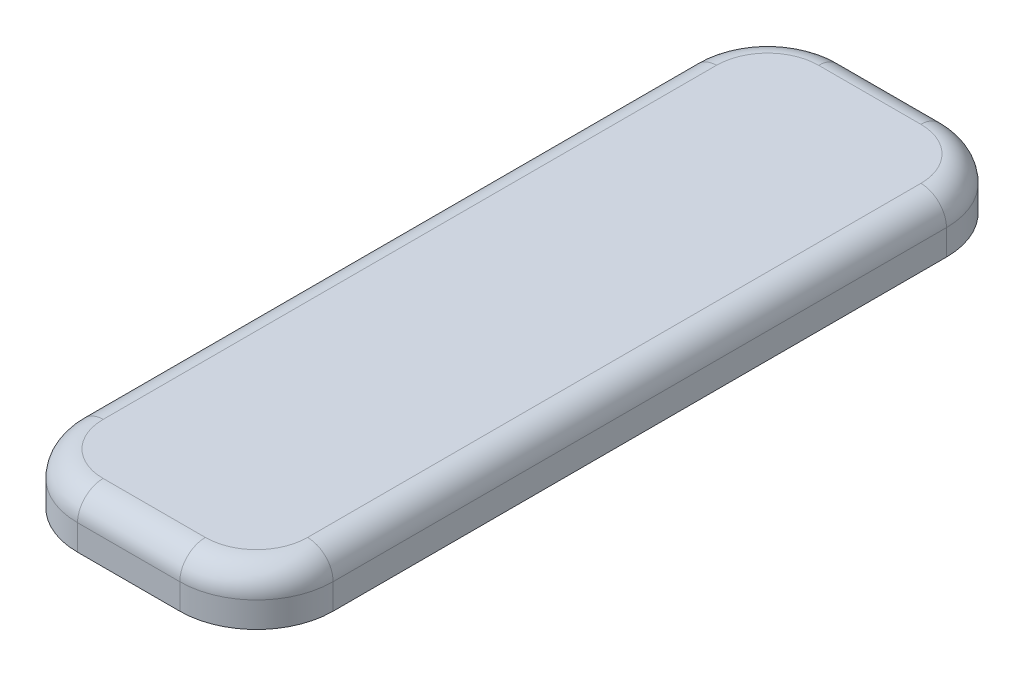
ISO-10303-21;
HEADER;
FILE_DESCRIPTION(('STEP AP214'),'2;1');
FILE_NAME('part.step','',(''),(''),'','','');
FILE_SCHEMA(('AUTOMOTIVE_DESIGN { 1 0 10303 214 1 1 1 1 }'));
ENDSEC;
DATA;
#1=APPLICATION_CONTEXT('core data for automotive mechanical design processes');
#2=APPLICATION_PROTOCOL_DEFINITION('international standard','automotive_design',2000,#1);
#3=PRODUCT_CONTEXT('',#1,'mechanical');
#4=PRODUCT('Part','Part','',(#3));
#5=PRODUCT_RELATED_PRODUCT_CATEGORY('part','',(#4));
#6=PRODUCT_DEFINITION_FORMATION('','',#4);
#7=PRODUCT_DEFINITION_CONTEXT('part definition',#1,'design');
#8=PRODUCT_DEFINITION('design','',#6,#7);
#9=PRODUCT_DEFINITION_SHAPE('','',#8);
#10=(LENGTH_UNIT() NAMED_UNIT(*) SI_UNIT(.MILLI.,.METRE.));
#11=(NAMED_UNIT(*) PLANE_ANGLE_UNIT() SI_UNIT($,.RADIAN.));
#12=(NAMED_UNIT(*) SI_UNIT($,.STERADIAN.) SOLID_ANGLE_UNIT());
#13=UNCERTAINTY_MEASURE_WITH_UNIT(LENGTH_MEASURE(1.E-05),#10,'distance_accuracy_value','');
#14=(GEOMETRIC_REPRESENTATION_CONTEXT(3) GLOBAL_UNCERTAINTY_ASSIGNED_CONTEXT((#13)) GLOBAL_UNIT_ASSIGNED_CONTEXT((#10,
#11,#12)) REPRESENTATION_CONTEXT('',''));
#15=CARTESIAN_POINT('',(0.,0.,0.));
#16=DIRECTION('',(0.,0.,1.));
#17=DIRECTION('',(1.,0.,0.));
#18=AXIS2_PLACEMENT_3D('',#15,#16,#17);
#19=CARTESIAN_POINT('',(-20.,20.,-120.));
#20=DIRECTION('',(0.,-1.,0.));
#21=DIRECTION('',(0.,0.,-1.));
#22=AXIS2_PLACEMENT_3D('',#19,#20,#21);
#23=CYLINDRICAL_SURFACE('',#22,30.);
#24=DIRECTION('',(0.,-1.,0.));
#25=VECTOR('',#24,1.);
#26=CARTESIAN_POINT('',(-50.,20.,-120.));
#27=LINE('',#26,#25);
#28=CARTESIAN_POINT('',(-50.,10.,-120.));
#29=VERTEX_POINT('',#28);
#30=CARTESIAN_POINT('',(-50.,0.,-120.));
#31=VERTEX_POINT('',#30);
#32=EDGE_CURVE('E124',#29,#31,#27,.T.);
#33=ORIENTED_EDGE('',*,*,#32,.F.);
#34=CARTESIAN_POINT('',(-20.,10.,-120.));
#35=DIRECTION('',(0.,-1.,0.));
#36=DIRECTION('',(0.,0.,-1.));
#37=AXIS2_PLACEMENT_3D('',#34,#35,#36);
#38=CIRCLE('',#37,30.);
#39=CARTESIAN_POINT('',(-19.9999999999998,10.,-150.));
#40=VERTEX_POINT('',#39);
#41=EDGE_CURVE('E11',#29,#40,#38,.T.);
#42=ORIENTED_EDGE('',*,*,#41,.T.);
#43=DIRECTION('',(0.,-1.,0.));
#44=VECTOR('',#43,1.);
#45=CARTESIAN_POINT('',(-19.9999999999998,20.,-150.));
#46=LINE('',#45,#44);
#47=CARTESIAN_POINT('',(-19.9999999999998,0.,-150.));
#48=VERTEX_POINT('',#47);
#49=EDGE_CURVE('E145',#40,#48,#46,.T.);
#50=ORIENTED_EDGE('',*,*,#49,.T.);
#51=CARTESIAN_POINT('',(-20.,0.,-120.));
#52=DIRECTION('',(0.,1.,0.));
#53=DIRECTION('',(0.,0.,-1.));
#54=AXIS2_PLACEMENT_3D('',#51,#52,#53);
#55=CIRCLE('',#54,30.);
#56=EDGE_CURVE('E139',#48,#31,#55,.T.);
#57=ORIENTED_EDGE('',*,*,#56,.T.);
#58=EDGE_LOOP('',(#33,#42,#50,#57));
#59=FACE_BOUND('',#58,.T.);
#60=ADVANCED_FACE('F36',(#59),#23,.T.);
#61=CARTESIAN_POINT('',(-50.,20.,120.));
#62=DIRECTION('',(1.,0.,0.));
#63=DIRECTION('',(0.,0.,-1.));
#64=AXIS2_PLACEMENT_3D('',#61,#62,#63);
#65=PLANE('',#64);
#66=DIRECTION('',(0.,-1.,0.));
#67=VECTOR('',#66,1.);
#68=CARTESIAN_POINT('',(-50.,20.,120.));
#69=LINE('',#68,#67);
#70=CARTESIAN_POINT('',(-50.,10.,120.));
#71=VERTEX_POINT('',#70);
#72=CARTESIAN_POINT('',(-50.,0.,120.));
#73=VERTEX_POINT('',#72);
#74=EDGE_CURVE('E133',#71,#73,#69,.T.);
#75=ORIENTED_EDGE('',*,*,#74,.F.);
#76=DIRECTION('',(0.,0.,1.));
#77=VECTOR('',#76,1.);
#78=CARTESIAN_POINT('',(-50.,10.,120.));
#79=LINE('',#78,#77);
#80=EDGE_CURVE('E45',#71,#29,#79,.F.);
#81=ORIENTED_EDGE('',*,*,#80,.T.);
#82=ORIENTED_EDGE('',*,*,#32,.T.);
#83=DIRECTION('',(0.,0.,1.));
#84=VECTOR('',#83,1.);
#85=CARTESIAN_POINT('',(-50.,0.,120.));
#86=LINE('',#85,#84);
#87=EDGE_CURVE('E127',#31,#73,#86,.T.);
#88=ORIENTED_EDGE('',*,*,#87,.T.);
#89=EDGE_LOOP('',(#75,#81,#82,#88));
#90=FACE_BOUND('',#89,.T.);
#91=ADVANCED_FACE('F126',(#90),#65,.F.);
#92=CARTESIAN_POINT('',(-20.,20.,120.));
#93=DIRECTION('',(0.,-1.,0.));
#94=DIRECTION('',(0.,0.,-1.));
#95=AXIS2_PLACEMENT_3D('',#92,#93,#94);
#96=CYLINDRICAL_SURFACE('',#95,30.);
#97=DIRECTION('',(0.,-1.,0.));
#98=VECTOR('',#97,1.);
#99=CARTESIAN_POINT('',(-19.9999999999998,20.,150.));
#100=LINE('',#99,#98);
#101=CARTESIAN_POINT('',(-19.9999999999998,10.,150.));
#102=VERTEX_POINT('',#101);
#103=CARTESIAN_POINT('',(-19.9999999999998,0.,150.));
#104=VERTEX_POINT('',#103);
#105=EDGE_CURVE('E175',#102,#104,#100,.T.);
#106=ORIENTED_EDGE('',*,*,#105,.F.);
#107=CARTESIAN_POINT('',(-20.,10.,120.));
#108=DIRECTION('',(0.,-1.,0.));
#109=DIRECTION('',(0.,0.,-1.));
#110=AXIS2_PLACEMENT_3D('',#107,#108,#109);
#111=CIRCLE('',#110,30.);
#112=EDGE_CURVE('E60',#102,#71,#111,.T.);
#113=ORIENTED_EDGE('',*,*,#112,.T.);
#114=ORIENTED_EDGE('',*,*,#74,.T.);
#115=CARTESIAN_POINT('',(-20.,0.,120.));
#116=DIRECTION('',(0.,1.,0.));
#117=DIRECTION('',(0.,0.,-1.));
#118=AXIS2_PLACEMENT_3D('',#115,#116,#117);
#119=CIRCLE('',#118,30.);
#120=EDGE_CURVE('E142',#73,#104,#119,.T.);
#121=ORIENTED_EDGE('',*,*,#120,.T.);
#122=EDGE_LOOP('',(#106,#113,#114,#121));
#123=FACE_BOUND('',#122,.T.);
#124=ADVANCED_FACE('F278',(#123),#96,.T.);
#125=CARTESIAN_POINT('',(-19.9999999999998,20.,150.));
#126=DIRECTION('',(0.,0.,-1.));
#127=DIRECTION('',(-1.,0.,0.));
#128=AXIS2_PLACEMENT_3D('',#125,#126,#127);
#129=PLANE('',#128);
#130=DIRECTION('',(0.,-1.,0.));
#131=VECTOR('',#130,1.);
#132=CARTESIAN_POINT('',(19.9999999999998,20.,150.));
#133=LINE('',#132,#131);
#134=CARTESIAN_POINT('',(19.9999999999998,10.,150.));
#135=VERTEX_POINT('',#134);
#136=CARTESIAN_POINT('',(19.9999999999998,0.,150.));
#137=VERTEX_POINT('',#136);
#138=EDGE_CURVE('E173',#135,#137,#133,.T.);
#139=ORIENTED_EDGE('',*,*,#138,.F.);
#140=DIRECTION('',(1.,0.,0.));
#141=VECTOR('',#140,1.);
#142=CARTESIAN_POINT('',(-19.9999999999998,10.,150.));
#143=LINE('',#142,#141);
#144=EDGE_CURVE('E203',#135,#102,#143,.F.);
#145=ORIENTED_EDGE('',*,*,#144,.T.);
#146=ORIENTED_EDGE('',*,*,#105,.T.);
#147=DIRECTION('',(1.,0.,0.));
#148=VECTOR('',#147,1.);
#149=CARTESIAN_POINT('',(-19.9999999999998,0.,150.));
#150=LINE('',#149,#148);
#151=EDGE_CURVE('E152',#104,#137,#150,.T.);
#152=ORIENTED_EDGE('',*,*,#151,.T.);
#153=EDGE_LOOP('',(#139,#145,#146,#152));
#154=FACE_BOUND('',#153,.T.);
#155=ADVANCED_FACE('F276',(#154),#129,.F.);
#156=CARTESIAN_POINT('',(20.,20.,120.));
#157=DIRECTION('',(0.,-1.,0.));
#158=DIRECTION('',(0.,0.,-1.));
#159=AXIS2_PLACEMENT_3D('',#156,#157,#158);
#160=CYLINDRICAL_SURFACE('',#159,30.);
#161=DIRECTION('',(0.,-1.,0.));
#162=VECTOR('',#161,1.);
#163=CARTESIAN_POINT('',(50.,20.,120.));
#164=LINE('',#163,#162);
#165=CARTESIAN_POINT('',(50.,10.,120.));
#166=VERTEX_POINT('',#165);
#167=CARTESIAN_POINT('',(50.,0.,120.));
#168=VERTEX_POINT('',#167);
#169=EDGE_CURVE('E171',#166,#168,#164,.T.);
#170=ORIENTED_EDGE('',*,*,#169,.F.);
#171=CARTESIAN_POINT('',(20.,10.,120.));
#172=DIRECTION('',(0.,-1.,0.));
#173=DIRECTION('',(0.,0.,-1.));
#174=AXIS2_PLACEMENT_3D('',#171,#172,#173);
#175=CIRCLE('',#174,30.);
#176=EDGE_CURVE('E201',#166,#135,#175,.T.);
#177=ORIENTED_EDGE('',*,*,#176,.T.);
#178=ORIENTED_EDGE('',*,*,#138,.T.);
#179=CARTESIAN_POINT('',(20.,0.,120.));
#180=DIRECTION('',(0.,1.,0.));
#181=DIRECTION('',(0.,0.,-1.));
#182=AXIS2_PLACEMENT_3D('',#179,#180,#181);
#183=CIRCLE('',#182,30.);
#184=EDGE_CURVE('E155',#137,#168,#183,.T.);
#185=ORIENTED_EDGE('',*,*,#184,.T.);
#186=EDGE_LOOP('',(#170,#177,#178,#185));
#187=FACE_BOUND('',#186,.T.);
#188=ADVANCED_FACE('F274',(#187),#160,.T.);
#189=CARTESIAN_POINT('',(50.,20.,120.));
#190=DIRECTION('',(-1.,0.,0.));
#191=DIRECTION('',(0.,0.,1.));
#192=AXIS2_PLACEMENT_3D('',#189,#190,#191);
#193=PLANE('',#192);
#194=DIRECTION('',(0.,-1.,0.));
#195=VECTOR('',#194,1.);
#196=CARTESIAN_POINT('',(50.,20.,-120.));
#197=LINE('',#196,#195);
#198=CARTESIAN_POINT('',(50.,10.,-120.));
#199=VERTEX_POINT('',#198);
#200=CARTESIAN_POINT('',(50.,0.,-120.));
#201=VERTEX_POINT('',#200);
#202=EDGE_CURVE('E169',#199,#201,#197,.T.);
#203=ORIENTED_EDGE('',*,*,#202,.F.);
#204=DIRECTION('',(0.,0.,-1.));
#205=VECTOR('',#204,1.);
#206=CARTESIAN_POINT('',(50.,10.,120.));
#207=LINE('',#206,#205);
#208=EDGE_CURVE('E199',#199,#166,#207,.F.);
#209=ORIENTED_EDGE('',*,*,#208,.T.);
#210=ORIENTED_EDGE('',*,*,#169,.T.);
#211=DIRECTION('',(0.,0.,-1.));
#212=VECTOR('',#211,1.);
#213=CARTESIAN_POINT('',(50.,0.,120.));
#214=LINE('',#213,#212);
#215=EDGE_CURVE('E158',#168,#201,#214,.T.);
#216=ORIENTED_EDGE('',*,*,#215,.T.);
#217=EDGE_LOOP('',(#203,#209,#210,#216));
#218=FACE_BOUND('',#217,.T.);
#219=ADVANCED_FACE('F262',(#218),#193,.F.);
#220=CARTESIAN_POINT('',(20.,20.,-120.));
#221=DIRECTION('',(0.,-1.,0.));
#222=DIRECTION('',(0.,0.,-1.));
#223=AXIS2_PLACEMENT_3D('',#220,#221,#222);
#224=CYLINDRICAL_SURFACE('',#223,30.);
#225=DIRECTION('',(0.,-1.,0.));
#226=VECTOR('',#225,1.);
#227=CARTESIAN_POINT('',(19.9999999999998,20.,-150.));
#228=LINE('',#227,#226);
#229=CARTESIAN_POINT('',(19.9999999999998,10.,-150.));
#230=VERTEX_POINT('',#229);
#231=CARTESIAN_POINT('',(19.9999999999998,0.,-150.));
#232=VERTEX_POINT('',#231);
#233=EDGE_CURVE('E167',#230,#232,#228,.T.);
#234=ORIENTED_EDGE('',*,*,#233,.F.);
#235=CARTESIAN_POINT('',(20.,10.,-120.));
#236=DIRECTION('',(0.,-1.,0.));
#237=DIRECTION('',(0.,0.,-1.));
#238=AXIS2_PLACEMENT_3D('',#235,#236,#237);
#239=CIRCLE('',#238,30.);
#240=EDGE_CURVE('E197',#230,#199,#239,.T.);
#241=ORIENTED_EDGE('',*,*,#240,.T.);
#242=ORIENTED_EDGE('',*,*,#202,.T.);
#243=CARTESIAN_POINT('',(20.,0.,-120.));
#244=DIRECTION('',(0.,1.,0.));
#245=DIRECTION('',(0.,0.,-1.));
#246=AXIS2_PLACEMENT_3D('',#243,#244,#245);
#247=CIRCLE('',#246,30.);
#248=EDGE_CURVE('E161',#201,#232,#247,.T.);
#249=ORIENTED_EDGE('',*,*,#248,.T.);
#250=EDGE_LOOP('',(#234,#241,#242,#249));
#251=FACE_BOUND('',#250,.T.);
#252=ADVANCED_FACE('F259',(#251),#224,.T.);
#253=CARTESIAN_POINT('',(-19.9999999999998,20.,-150.));
#254=DIRECTION('',(0.,0.,1.));
#255=DIRECTION('',(1.,0.,0.));
#256=AXIS2_PLACEMENT_3D('',#253,#254,#255);
#257=PLANE('',#256);
#258=ORIENTED_EDGE('',*,*,#49,.F.);
#259=DIRECTION('',(-1.,0.,0.));
#260=VECTOR('',#259,1.);
#261=CARTESIAN_POINT('',(-19.9999999999998,10.,-150.));
#262=LINE('',#261,#260);
#263=EDGE_CURVE('E194',#40,#230,#262,.F.);
#264=ORIENTED_EDGE('',*,*,#263,.T.);
#265=ORIENTED_EDGE('',*,*,#233,.T.);
#266=DIRECTION('',(-1.,0.,0.));
#267=VECTOR('',#266,1.);
#268=CARTESIAN_POINT('',(-19.9999999999998,0.,-150.));
#269=LINE('',#268,#267);
#270=EDGE_CURVE('E164',#232,#48,#269,.T.);
#271=ORIENTED_EDGE('',*,*,#270,.T.);
#272=EDGE_LOOP('',(#258,#264,#265,#271));
#273=FACE_BOUND('',#272,.T.);
#274=ADVANCED_FACE('F246',(#273),#257,.F.);
#275=CARTESIAN_POINT('',(-20.,20.,-120.));
#276=DIRECTION('',(0.,-1.,0.));
#277=DIRECTION('',(0.,0.,-1.));
#278=AXIS2_PLACEMENT_3D('',#275,#276,#277);
#279=PLANE('',#278);
#280=CARTESIAN_POINT('',(20.,20.,-120.));
#281=DIRECTION('',(0.,-1.,0.));
#282=DIRECTION('',(0.,0.,-1.));
#283=AXIS2_PLACEMENT_3D('',#280,#281,#282);
#284=CIRCLE('',#283,20.);
#285=CARTESIAN_POINT('',(40.,20.,-120.));
#286=VERTEX_POINT('',#285);
#287=CARTESIAN_POINT('',(19.9999999999998,20.,-140.));
#288=VERTEX_POINT('',#287);
#289=EDGE_CURVE('E189',#286,#288,#284,.F.);
#290=ORIENTED_EDGE('',*,*,#289,.T.);
#291=DIRECTION('',(-1.,0.,0.));
#292=VECTOR('',#291,1.);
#293=CARTESIAN_POINT('',(-20.,20.,-140.));
#294=LINE('',#293,#292);
#295=CARTESIAN_POINT('',(-19.9999999999998,20.,-140.));
#296=VERTEX_POINT('',#295);
#297=EDGE_CURVE('E191',#288,#296,#294,.T.);
#298=ORIENTED_EDGE('',*,*,#297,.T.);
#299=CARTESIAN_POINT('',(-20.,20.,-120.));
#300=DIRECTION('',(0.,-1.,0.));
#301=DIRECTION('',(0.,0.,-1.));
#302=AXIS2_PLACEMENT_3D('',#299,#300,#301);
#303=CIRCLE('',#302,20.);
#304=CARTESIAN_POINT('',(-40.,20.,-120.));
#305=VERTEX_POINT('',#304);
#306=EDGE_CURVE('E132',#296,#305,#303,.F.);
#307=ORIENTED_EDGE('',*,*,#306,.T.);
#308=DIRECTION('',(0.,0.,1.));
#309=VECTOR('',#308,1.);
#310=CARTESIAN_POINT('',(-40.,20.,-120.));
#311=LINE('',#310,#309);
#312=CARTESIAN_POINT('',(-40.,20.,120.));
#313=VERTEX_POINT('',#312);
#314=EDGE_CURVE('E179',#305,#313,#311,.T.);
#315=ORIENTED_EDGE('',*,*,#314,.T.);
#316=CARTESIAN_POINT('',(-20.,20.,120.));
#317=DIRECTION('',(0.,-1.,0.));
#318=DIRECTION('',(0.,0.,-1.));
#319=AXIS2_PLACEMENT_3D('',#316,#317,#318);
#320=CIRCLE('',#319,20.);
#321=CARTESIAN_POINT('',(-19.9999999999998,20.,140.));
#322=VERTEX_POINT('',#321);
#323=EDGE_CURVE('E181',#313,#322,#320,.F.);
#324=ORIENTED_EDGE('',*,*,#323,.T.);
#325=DIRECTION('',(1.,0.,0.));
#326=VECTOR('',#325,1.);
#327=CARTESIAN_POINT('',(-20.,20.,140.));
#328=LINE('',#327,#326);
#329=CARTESIAN_POINT('',(19.9999999999999,20.,140.));
#330=VERTEX_POINT('',#329);
#331=EDGE_CURVE('E183',#322,#330,#328,.T.);
#332=ORIENTED_EDGE('',*,*,#331,.T.);
#333=CARTESIAN_POINT('',(20.,20.,120.));
#334=DIRECTION('',(0.,-1.,0.));
#335=DIRECTION('',(0.,0.,-1.));
#336=AXIS2_PLACEMENT_3D('',#333,#334,#335);
#337=CIRCLE('',#336,20.);
#338=CARTESIAN_POINT('',(40.,20.,120.));
#339=VERTEX_POINT('',#338);
#340=EDGE_CURVE('E185',#330,#339,#337,.F.);
#341=ORIENTED_EDGE('',*,*,#340,.T.);
#342=DIRECTION('',(0.,0.,-1.));
#343=VECTOR('',#342,1.);
#344=CARTESIAN_POINT('',(40.,20.,-120.));
#345=LINE('',#344,#343);
#346=EDGE_CURVE('E187',#339,#286,#345,.T.);
#347=ORIENTED_EDGE('',*,*,#346,.T.);
#348=EDGE_LOOP('',(#290,#298,#307,#315,#324,#332,#341,#347));
#349=FACE_BOUND('',#348,.T.);
#350=ADVANCED_FACE('F234',(#349),#279,.F.);
#351=CARTESIAN_POINT('',(-20.,0.,-120.));
#352=DIRECTION('',(0.,-1.,0.));
#353=DIRECTION('',(0.,0.,-1.));
#354=AXIS2_PLACEMENT_3D('',#351,#352,#353);
#355=PLANE('',#354);
#356=ORIENTED_EDGE('',*,*,#56,.F.);
#357=ORIENTED_EDGE('',*,*,#270,.F.);
#358=ORIENTED_EDGE('',*,*,#248,.F.);
#359=ORIENTED_EDGE('',*,*,#215,.F.);
#360=ORIENTED_EDGE('',*,*,#184,.F.);
#361=ORIENTED_EDGE('',*,*,#151,.F.);
#362=ORIENTED_EDGE('',*,*,#120,.F.);
#363=ORIENTED_EDGE('',*,*,#87,.F.);
#364=EDGE_LOOP('',(#356,#357,#358,#359,#360,#361,#362,#363));
#365=FACE_BOUND('',#364,.T.);
#366=ADVANCED_FACE('F137',(#365),#355,.T.);
#367=CARTESIAN_POINT('',(-20.,10.,140.));
#368=DIRECTION('',(1.,0.,0.));
#369=DIRECTION('',(0.,0.,-1.));
#370=AXIS2_PLACEMENT_3D('',#367,#368,#369);
#371=CYLINDRICAL_SURFACE('',#370,10.);
#372=CARTESIAN_POINT('',(-19.9999999999998,10.,140.));
#373=DIRECTION('',(-1.,0.,0.));
#374=DIRECTION('',(0.,0.,1.));
#375=AXIS2_PLACEMENT_3D('',#372,#373,#374);
#376=CIRCLE('',#375,10.);
#377=EDGE_CURVE('E149',#102,#322,#376,.T.);
#378=ORIENTED_EDGE('',*,*,#377,.F.);
#379=ORIENTED_EDGE('',*,*,#144,.F.);
#380=CARTESIAN_POINT('',(19.9999999999999,10.,140.));
#381=DIRECTION('',(1.,0.,0.));
#382=DIRECTION('',(0.,0.,-1.));
#383=AXIS2_PLACEMENT_3D('',#380,#381,#382);
#384=CIRCLE('',#383,10.);
#385=EDGE_CURVE('E40',#330,#135,#384,.T.);
#386=ORIENTED_EDGE('',*,*,#385,.F.);
#387=ORIENTED_EDGE('',*,*,#331,.F.);
#388=EDGE_LOOP('',(#378,#379,#386,#387));
#389=FACE_BOUND('',#388,.T.);
#390=ADVANCED_FACE('F38',(#389),#371,.T.);
#391=CARTESIAN_POINT('',(20.,10.,120.));
#392=DIRECTION('',(0.,-1.,0.));
#393=DIRECTION('',(0.,0.,-1.));
#394=AXIS2_PLACEMENT_3D('',#391,#392,#393);
#395=TOROIDAL_SURFACE('',#394,20.,10.);
#396=ORIENTED_EDGE('',*,*,#385,.T.);
#397=ORIENTED_EDGE('',*,*,#176,.F.);
#398=CARTESIAN_POINT('',(40.,10.,120.));
#399=DIRECTION('',(0.,0.,-1.));
#400=DIRECTION('',(-1.,0.,0.));
#401=AXIS2_PLACEMENT_3D('',#398,#399,#400);
#402=CIRCLE('',#401,10.);
#403=EDGE_CURVE('E220',#339,#166,#402,.T.);
#404=ORIENTED_EDGE('',*,*,#403,.F.);
#405=ORIENTED_EDGE('',*,*,#340,.F.);
#406=EDGE_LOOP('',(#396,#397,#404,#405));
#407=FACE_BOUND('',#406,.T.);
#408=ADVANCED_FACE('F271',(#407),#395,.T.);
#409=CARTESIAN_POINT('',(-20.,10.,120.));
#410=DIRECTION('',(0.,-1.,0.));
#411=DIRECTION('',(0.,0.,-1.));
#412=AXIS2_PLACEMENT_3D('',#409,#410,#411);
#413=TOROIDAL_SURFACE('',#412,20.,10.);
#414=ORIENTED_EDGE('',*,*,#377,.T.);
#415=ORIENTED_EDGE('',*,*,#323,.F.);
#416=CARTESIAN_POINT('',(-40.,10.,120.));
#417=DIRECTION('',(0.,0.,-1.));
#418=DIRECTION('',(-1.,0.,0.));
#419=AXIS2_PLACEMENT_3D('',#416,#417,#418);
#420=CIRCLE('',#419,10.);
#421=EDGE_CURVE('E217',#71,#313,#420,.T.);
#422=ORIENTED_EDGE('',*,*,#421,.F.);
#423=ORIENTED_EDGE('',*,*,#112,.F.);
#424=EDGE_LOOP('',(#414,#415,#422,#423));
#425=FACE_BOUND('',#424,.T.);
#426=ADVANCED_FACE('F226',(#425),#413,.T.);
#427=CARTESIAN_POINT('',(40.,10.,-120.));
#428=DIRECTION('',(0.,0.,-1.));
#429=DIRECTION('',(-1.,0.,0.));
#430=AXIS2_PLACEMENT_3D('',#427,#428,#429);
#431=CYLINDRICAL_SURFACE('',#430,10.);
#432=ORIENTED_EDGE('',*,*,#403,.T.);
#433=ORIENTED_EDGE('',*,*,#208,.F.);
#434=CARTESIAN_POINT('',(40.,10.,-120.));
#435=DIRECTION('',(0.,0.,-1.));
#436=DIRECTION('',(-1.,0.,0.));
#437=AXIS2_PLACEMENT_3D('',#434,#435,#436);
#438=CIRCLE('',#437,10.);
#439=EDGE_CURVE('E214',#286,#199,#438,.T.);
#440=ORIENTED_EDGE('',*,*,#439,.F.);
#441=ORIENTED_EDGE('',*,*,#346,.F.);
#442=EDGE_LOOP('',(#432,#433,#440,#441));
#443=FACE_BOUND('',#442,.T.);
#444=ADVANCED_FACE('F267',(#443),#431,.T.);
#445=CARTESIAN_POINT('',(-40.,10.,-120.));
#446=DIRECTION('',(0.,0.,1.));
#447=DIRECTION('',(1.,0.,0.));
#448=AXIS2_PLACEMENT_3D('',#445,#446,#447);
#449=CYLINDRICAL_SURFACE('',#448,10.);
#450=ORIENTED_EDGE('',*,*,#421,.T.);
#451=ORIENTED_EDGE('',*,*,#314,.F.);
#452=CARTESIAN_POINT('',(-40.,10.,-120.));
#453=DIRECTION('',(0.,0.,-1.));
#454=DIRECTION('',(-1.,0.,0.));
#455=AXIS2_PLACEMENT_3D('',#452,#453,#454);
#456=CIRCLE('',#455,10.);
#457=EDGE_CURVE('E211',#29,#305,#456,.T.);
#458=ORIENTED_EDGE('',*,*,#457,.F.);
#459=ORIENTED_EDGE('',*,*,#80,.F.);
#460=EDGE_LOOP('',(#450,#451,#458,#459));
#461=FACE_BOUND('',#460,.T.);
#462=ADVANCED_FACE('F239',(#461),#449,.T.);
#463=CARTESIAN_POINT('',(20.,10.,-120.));
#464=DIRECTION('',(0.,-1.,0.));
#465=DIRECTION('',(0.,0.,-1.));
#466=AXIS2_PLACEMENT_3D('',#463,#464,#465);
#467=TOROIDAL_SURFACE('',#466,20.,10.);
#468=ORIENTED_EDGE('',*,*,#439,.T.);
#469=ORIENTED_EDGE('',*,*,#240,.F.);
#470=CARTESIAN_POINT('',(19.9999999999998,10.,-140.));
#471=DIRECTION('',(-1.,0.,0.));
#472=DIRECTION('',(0.,0.,1.));
#473=AXIS2_PLACEMENT_3D('',#470,#471,#472);
#474=CIRCLE('',#473,10.);
#475=EDGE_CURVE('E209',#288,#230,#474,.T.);
#476=ORIENTED_EDGE('',*,*,#475,.F.);
#477=ORIENTED_EDGE('',*,*,#289,.F.);
#478=EDGE_LOOP('',(#468,#469,#476,#477));
#479=FACE_BOUND('',#478,.T.);
#480=ADVANCED_FACE('F255',(#479),#467,.T.);
#481=CARTESIAN_POINT('',(-20.,10.,-120.));
#482=DIRECTION('',(0.,-1.,0.));
#483=DIRECTION('',(0.,0.,-1.));
#484=AXIS2_PLACEMENT_3D('',#481,#482,#483);
#485=TOROIDAL_SURFACE('',#484,20.,10.);
#486=ORIENTED_EDGE('',*,*,#457,.T.);
#487=ORIENTED_EDGE('',*,*,#306,.F.);
#488=CARTESIAN_POINT('',(-19.9999999999999,10.,-140.));
#489=DIRECTION('',(1.,0.,0.));
#490=DIRECTION('',(0.,1.,0.));
#491=AXIS2_PLACEMENT_3D('',#488,#489,#490);
#492=CIRCLE('',#491,10.);
#493=EDGE_CURVE('E207',#40,#296,#492,.T.);
#494=ORIENTED_EDGE('',*,*,#493,.F.);
#495=ORIENTED_EDGE('',*,*,#41,.F.);
#496=EDGE_LOOP('',(#486,#487,#494,#495));
#497=FACE_BOUND('',#496,.T.);
#498=ADVANCED_FACE('F242',(#497),#485,.T.);
#499=CARTESIAN_POINT('',(-20.,10.,-140.));
#500=DIRECTION('',(-1.,0.,0.));
#501=DIRECTION('',(0.,0.,1.));
#502=AXIS2_PLACEMENT_3D('',#499,#500,#501);
#503=CYLINDRICAL_SURFACE('',#502,10.);
#504=ORIENTED_EDGE('',*,*,#475,.T.);
#505=ORIENTED_EDGE('',*,*,#263,.F.);
#506=ORIENTED_EDGE('',*,*,#493,.T.);
#507=ORIENTED_EDGE('',*,*,#297,.F.);
#508=EDGE_LOOP('',(#504,#505,#506,#507));
#509=FACE_BOUND('',#508,.T.);
#510=ADVANCED_FACE('F249',(#509),#503,.T.);
#511=CLOSED_SHELL('',(#60,#91,#124,#155,#188,#219,#252,#274,#350,#366,#390,#408,#426,#444,#462,
#480,#498,#510));
#512=MANIFOLD_SOLID_BREP('B2',#511);
#513=ADVANCED_BREP_SHAPE_REPRESENTATION('',(#18,#512),#14);
#514=SHAPE_DEFINITION_REPRESENTATION(#9,#513);
ENDSEC;
END-ISO-10303-21;
